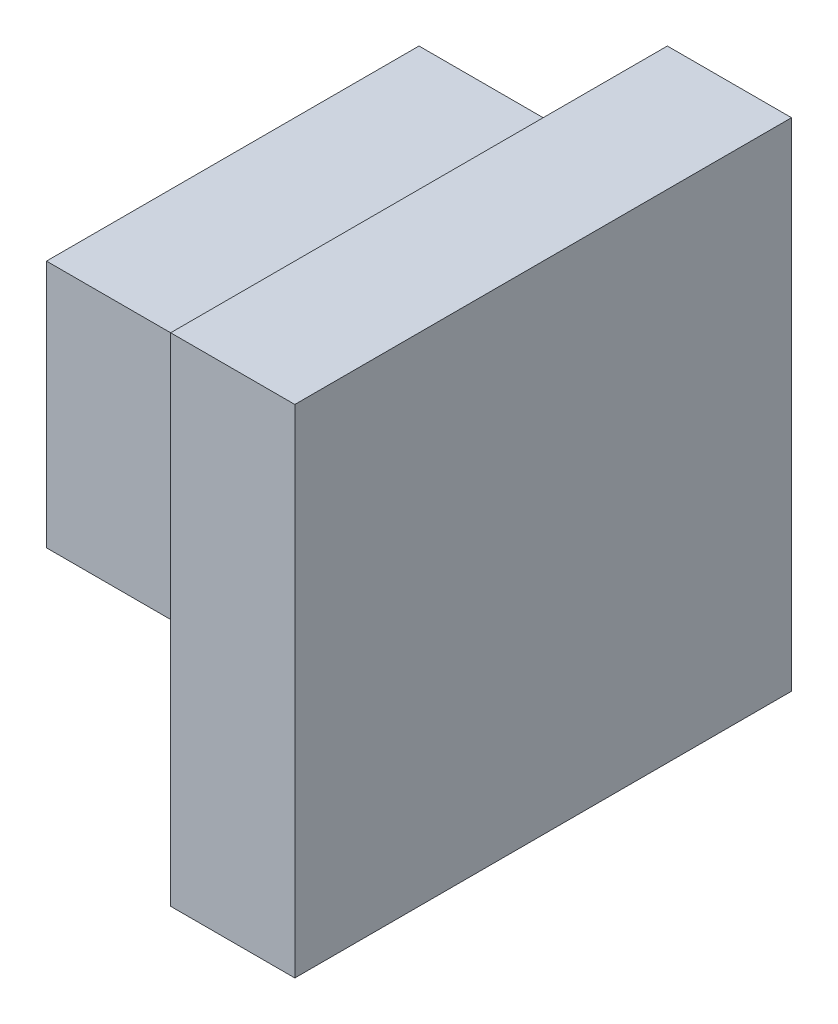
ISO-10303-21;
HEADER;
FILE_DESCRIPTION(('STEP AP214'),'2;1');
FILE_NAME('part.step','',(''),(''),'','','');
FILE_SCHEMA(('AUTOMOTIVE_DESIGN { 1 0 10303 214 1 1 1 1 }'));
ENDSEC;
DATA;
#1=APPLICATION_CONTEXT('core data for automotive mechanical design processes');
#2=APPLICATION_PROTOCOL_DEFINITION('international standard','automotive_design',2000,#1);
#3=PRODUCT_CONTEXT('',#1,'mechanical');
#4=PRODUCT('Part','Part','',(#3));
#5=PRODUCT_RELATED_PRODUCT_CATEGORY('part','',(#4));
#6=PRODUCT_DEFINITION_FORMATION('','',#4);
#7=PRODUCT_DEFINITION_CONTEXT('part definition',#1,'design');
#8=PRODUCT_DEFINITION('design','',#6,#7);
#9=PRODUCT_DEFINITION_SHAPE('','',#8);
#10=(LENGTH_UNIT() NAMED_UNIT(*) SI_UNIT(.MILLI.,.METRE.));
#11=(NAMED_UNIT(*) PLANE_ANGLE_UNIT() SI_UNIT($,.RADIAN.));
#12=(NAMED_UNIT(*) SI_UNIT($,.STERADIAN.) SOLID_ANGLE_UNIT());
#13=UNCERTAINTY_MEASURE_WITH_UNIT(LENGTH_MEASURE(1.E-05),#10,'distance_accuracy_value','');
#14=(GEOMETRIC_REPRESENTATION_CONTEXT(3) GLOBAL_UNCERTAINTY_ASSIGNED_CONTEXT((#13)) GLOBAL_UNIT_ASSIGNED_CONTEXT((#10,
#11,#12)) REPRESENTATION_CONTEXT('',''));
#15=CARTESIAN_POINT('',(0.,0.,0.));
#16=DIRECTION('',(0.,0.,1.));
#17=DIRECTION('',(1.,0.,0.));
#18=AXIS2_PLACEMENT_3D('',#15,#16,#17);
#19=CARTESIAN_POINT('',(3.,1.,4.));
#20=DIRECTION('',(0.,1.,0.));
#21=DIRECTION('',(-1.,0.,0.));
#22=AXIS2_PLACEMENT_3D('',#19,#20,#21);
#23=PLANE('',#22);
#24=DIRECTION('',(1.,0.,0.));
#25=VECTOR('',#24,1.);
#26=CARTESIAN_POINT('',(3.,1.,3.));
#27=LINE('',#26,#25);
#28=CARTESIAN_POINT('',(1.,1.,3.));
#29=VERTEX_POINT('',#28);
#30=CARTESIAN_POINT('',(3.,1.,3.));
#31=VERTEX_POINT('',#30);
#32=EDGE_CURVE('E138',#29,#31,#27,.T.);
#33=ORIENTED_EDGE('',*,*,#32,.F.);
#34=DIRECTION('',(0.,0.,-1.));
#35=VECTOR('',#34,1.);
#36=CARTESIAN_POINT('',(1.,1.,4.));
#37=LINE('',#36,#35);
#38=CARTESIAN_POINT('',(1.,1.,2.));
#39=VERTEX_POINT('',#38);
#40=EDGE_CURVE('E42',#29,#39,#37,.T.);
#41=ORIENTED_EDGE('',*,*,#40,.T.);
#42=CARTESIAN_POINT('',(1.,1.,0.));
#43=VERTEX_POINT('',#42);
#44=EDGE_CURVE('E171',#39,#43,#37,.T.);
#45=ORIENTED_EDGE('',*,*,#44,.T.);
#46=DIRECTION('',(1.,0.,0.));
#47=VECTOR('',#46,1.);
#48=CARTESIAN_POINT('',(3.,1.,0.));
#49=LINE('',#48,#47);
#50=CARTESIAN_POINT('',(3.,1.,0.));
#51=VERTEX_POINT('',#50);
#52=EDGE_CURVE('E179',#43,#51,#49,.T.);
#53=ORIENTED_EDGE('',*,*,#52,.T.);
#54=DIRECTION('',(0.,0.,-1.));
#55=VECTOR('',#54,1.);
#56=CARTESIAN_POINT('',(3.,1.,4.));
#57=LINE('',#56,#55);
#58=EDGE_CURVE('E170',#31,#51,#57,.T.);
#59=ORIENTED_EDGE('',*,*,#58,.F.);
#60=EDGE_LOOP('',(#33,#41,#45,#53,#59));
#61=FACE_BOUND('',#60,.T.);
#62=ADVANCED_FACE('F33',(#61),#23,.F.);
#63=CARTESIAN_POINT('',(1.,3.,4.));
#64=DIRECTION('',(0.,-1.,0.));
#65=DIRECTION('',(0.,0.,-1.));
#66=AXIS2_PLACEMENT_3D('',#63,#64,#65);
#67=PLANE('',#66);
#68=DIRECTION('',(-1.,0.,0.));
#69=VECTOR('',#68,1.);
#70=CARTESIAN_POINT('',(1.,3.,3.));
#71=LINE('',#70,#69);
#72=CARTESIAN_POINT('',(3.,3.,3.));
#73=VERTEX_POINT('',#72);
#74=CARTESIAN_POINT('',(1.,3.,3.));
#75=VERTEX_POINT('',#74);
#76=EDGE_CURVE('E135',#73,#75,#71,.T.);
#77=ORIENTED_EDGE('',*,*,#76,.F.);
#78=DIRECTION('',(0.,0.,-1.));
#79=VECTOR('',#78,1.);
#80=CARTESIAN_POINT('',(3.,3.,4.));
#81=LINE('',#80,#79);
#82=CARTESIAN_POINT('',(3.,3.,0.));
#83=VERTEX_POINT('',#82);
#84=EDGE_CURVE('E147',#73,#83,#81,.T.);
#85=ORIENTED_EDGE('',*,*,#84,.T.);
#86=DIRECTION('',(-1.,0.,0.));
#87=VECTOR('',#86,1.);
#88=CARTESIAN_POINT('',(1.,3.,0.));
#89=LINE('',#88,#87);
#90=CARTESIAN_POINT('',(1.,3.,0.));
#91=VERTEX_POINT('',#90);
#92=EDGE_CURVE('E206',#83,#91,#89,.T.);
#93=ORIENTED_EDGE('',*,*,#92,.T.);
#94=DIRECTION('',(0.,0.,-1.));
#95=VECTOR('',#94,1.);
#96=CARTESIAN_POINT('',(1.,3.,4.));
#97=LINE('',#96,#95);
#98=EDGE_CURVE('E149',#75,#91,#97,.T.);
#99=ORIENTED_EDGE('',*,*,#98,.F.);
#100=EDGE_LOOP('',(#77,#85,#93,#99));
#101=FACE_BOUND('',#100,.T.);
#102=ADVANCED_FACE('F145',(#101),#67,.F.);
#103=CARTESIAN_POINT('',(1.,2.,4.));
#104=DIRECTION('',(1.,0.,0.));
#105=DIRECTION('',(0.,0.,-1.));
#106=AXIS2_PLACEMENT_3D('',#103,#104,#105);
#107=PLANE('',#106);
#108=DIRECTION('',(0.,-1.,0.));
#109=VECTOR('',#108,1.);
#110=CARTESIAN_POINT('',(1.,3.,3.));
#111=LINE('',#110,#109);
#112=EDGE_CURVE('E141',#75,#29,#111,.T.);
#113=ORIENTED_EDGE('',*,*,#112,.F.);
#114=ORIENTED_EDGE('',*,*,#98,.T.);
#115=DIRECTION('',(0.,-1.,0.));
#116=VECTOR('',#115,1.);
#117=CARTESIAN_POINT('',(1.,2.,0.));
#118=LINE('',#117,#116);
#119=CARTESIAN_POINT('',(1.,2.,0.));
#120=VERTEX_POINT('',#119);
#121=EDGE_CURVE('E208',#91,#120,#118,.T.);
#122=ORIENTED_EDGE('',*,*,#121,.T.);
#123=DIRECTION('',(0.,0.,-1.));
#124=VECTOR('',#123,1.);
#125=CARTESIAN_POINT('',(1.,2.,4.));
#126=LINE('',#125,#124);
#127=CARTESIAN_POINT('',(1.,2.,2.));
#128=VERTEX_POINT('',#127);
#129=EDGE_CURVE('E159',#128,#120,#126,.T.);
#130=ORIENTED_EDGE('',*,*,#129,.F.);
#131=DIRECTION('',(0.,1.,0.));
#132=VECTOR('',#131,1.);
#133=CARTESIAN_POINT('',(1.,3.,2.));
#134=LINE('',#133,#132);
#135=EDGE_CURVE('E235',#39,#128,#134,.T.);
#136=ORIENTED_EDGE('',*,*,#135,.F.);
#137=ORIENTED_EDGE('',*,*,#40,.F.);
#138=EDGE_LOOP('',(#113,#114,#122,#130,#136,#137));
#139=FACE_BOUND('',#138,.T.);
#140=ADVANCED_FACE('F226',(#139),#107,.F.);
#141=CARTESIAN_POINT('',(1.,0.,4.));
#142=DIRECTION('',(0.,1.,0.));
#143=DIRECTION('',(-1.,0.,0.));
#144=AXIS2_PLACEMENT_3D('',#141,#142,#143);
#145=PLANE('',#144);
#146=DIRECTION('',(0.,0.,-1.));
#147=VECTOR('',#146,1.);
#148=CARTESIAN_POINT('',(1.,0.,4.));
#149=LINE('',#148,#147);
#150=CARTESIAN_POINT('',(1.,0.,2.));
#151=VERTEX_POINT('',#150);
#152=CARTESIAN_POINT('',(1.,0.,0.));
#153=VERTEX_POINT('',#152);
#154=EDGE_CURVE('E11',#151,#153,#149,.T.);
#155=ORIENTED_EDGE('',*,*,#154,.F.);
#156=DIRECTION('',(1.,0.,0.));
#157=VECTOR('',#156,1.);
#158=CARTESIAN_POINT('',(1.,0.,2.));
#159=LINE('',#158,#157);
#160=CARTESIAN_POINT('',(0.,0.,2.));
#161=VERTEX_POINT('',#160);
#162=EDGE_CURVE('E230',#161,#151,#159,.T.);
#163=ORIENTED_EDGE('',*,*,#162,.F.);
#164=DIRECTION('',(0.,0.,-1.));
#165=VECTOR('',#164,1.);
#166=CARTESIAN_POINT('',(0.,0.,4.));
#167=LINE('',#166,#165);
#168=CARTESIAN_POINT('',(0.,0.,0.));
#169=VERTEX_POINT('',#168);
#170=EDGE_CURVE('E100',#161,#169,#167,.T.);
#171=ORIENTED_EDGE('',*,*,#170,.T.);
#172=DIRECTION('',(1.,0.,0.));
#173=VECTOR('',#172,1.);
#174=CARTESIAN_POINT('',(1.,0.,0.));
#175=LINE('',#174,#173);
#176=EDGE_CURVE('E189',#169,#153,#175,.T.);
#177=ORIENTED_EDGE('',*,*,#176,.T.);
#178=EDGE_LOOP('',(#155,#163,#171,#177));
#179=FACE_BOUND('',#178,.T.);
#180=ADVANCED_FACE('F35',(#179),#145,.F.);
#181=CARTESIAN_POINT('',(1.,1.,4.));
#182=DIRECTION('',(-1.,0.,0.));
#183=DIRECTION('',(0.,0.,1.));
#184=AXIS2_PLACEMENT_3D('',#181,#182,#183);
#185=PLANE('',#184);
#186=ORIENTED_EDGE('',*,*,#44,.F.);
#187=EDGE_CURVE('E231',#151,#39,#134,.T.);
#188=ORIENTED_EDGE('',*,*,#187,.F.);
#189=ORIENTED_EDGE('',*,*,#154,.T.);
#190=DIRECTION('',(0.,1.,0.));
#191=VECTOR('',#190,1.);
#192=CARTESIAN_POINT('',(1.,1.,0.));
#193=LINE('',#192,#191);
#194=EDGE_CURVE('E184',#153,#43,#193,.T.);
#195=ORIENTED_EDGE('',*,*,#194,.T.);
#196=EDGE_LOOP('',(#186,#188,#189,#195));
#197=FACE_BOUND('',#196,.T.);
#198=ADVANCED_FACE('F185',(#197),#185,.F.);
#199=CARTESIAN_POINT('',(4.,0.,4.));
#200=DIRECTION('',(0.,1.,0.));
#201=DIRECTION('',(-1.,0.,0.));
#202=AXIS2_PLACEMENT_3D('',#199,#200,#201);
#203=PLANE('',#202);
#204=DIRECTION('',(1.,0.,0.));
#205=VECTOR('',#204,1.);
#206=CARTESIAN_POINT('',(4.,0.,0.));
#207=LINE('',#206,#205);
#208=CARTESIAN_POINT('',(3.,0.,0.));
#209=VERTEX_POINT('',#208);
#210=CARTESIAN_POINT('',(4.,0.,0.));
#211=VERTEX_POINT('',#210);
#212=EDGE_CURVE('E196',#209,#211,#207,.T.);
#213=ORIENTED_EDGE('',*,*,#212,.T.);
#214=DIRECTION('',(0.,0.,-1.));
#215=VECTOR('',#214,1.);
#216=CARTESIAN_POINT('',(4.,0.,4.));
#217=LINE('',#216,#215);
#218=CARTESIAN_POINT('',(4.,0.,4.));
#219=VERTEX_POINT('',#218);
#220=EDGE_CURVE('E165',#219,#211,#217,.T.);
#221=ORIENTED_EDGE('',*,*,#220,.F.);
#222=DIRECTION('',(1.,0.,0.));
#223=VECTOR('',#222,1.);
#224=CARTESIAN_POINT('',(4.,0.,4.));
#225=LINE('',#224,#223);
#226=CARTESIAN_POINT('',(3.,0.,4.));
#227=VERTEX_POINT('',#226);
#228=EDGE_CURVE('E241',#227,#219,#225,.T.);
#229=ORIENTED_EDGE('',*,*,#228,.F.);
#230=DIRECTION('',(0.,0.,-1.));
#231=VECTOR('',#230,1.);
#232=CARTESIAN_POINT('',(3.,0.,4.));
#233=LINE('',#232,#231);
#234=EDGE_CURVE('E168',#227,#209,#233,.T.);
#235=ORIENTED_EDGE('',*,*,#234,.T.);
#236=EDGE_LOOP('',(#213,#221,#229,#235));
#237=FACE_BOUND('',#236,.T.);
#238=ADVANCED_FACE('F252',(#237),#203,.F.);
#239=CARTESIAN_POINT('',(4.,4.,4.));
#240=DIRECTION('',(-1.,0.,0.));
#241=DIRECTION('',(0.,-1.,0.));
#242=AXIS2_PLACEMENT_3D('',#239,#240,#241);
#243=PLANE('',#242);
#244=DIRECTION('',(0.,1.,0.));
#245=VECTOR('',#244,1.);
#246=CARTESIAN_POINT('',(4.,4.,0.));
#247=LINE('',#246,#245);
#248=CARTESIAN_POINT('',(4.,4.,0.));
#249=VERTEX_POINT('',#248);
#250=EDGE_CURVE('E201',#211,#249,#247,.T.);
#251=ORIENTED_EDGE('',*,*,#250,.T.);
#252=DIRECTION('',(0.,0.,-1.));
#253=VECTOR('',#252,1.);
#254=CARTESIAN_POINT('',(4.,4.,4.));
#255=LINE('',#254,#253);
#256=CARTESIAN_POINT('',(4.,4.,4.));
#257=VERTEX_POINT('',#256);
#258=EDGE_CURVE('E157',#257,#249,#255,.T.);
#259=ORIENTED_EDGE('',*,*,#258,.F.);
#260=DIRECTION('',(0.,1.,0.));
#261=VECTOR('',#260,1.);
#262=CARTESIAN_POINT('',(4.,4.,4.));
#263=LINE('',#262,#261);
#264=EDGE_CURVE('E243',#219,#257,#263,.T.);
#265=ORIENTED_EDGE('',*,*,#264,.F.);
#266=ORIENTED_EDGE('',*,*,#220,.T.);
#267=EDGE_LOOP('',(#251,#259,#265,#266));
#268=FACE_BOUND('',#267,.T.);
#269=ADVANCED_FACE('F255',(#268),#243,.F.);
#270=CARTESIAN_POINT('',(3.,4.,4.));
#271=DIRECTION('',(0.,-1.,0.));
#272=DIRECTION('',(0.,0.,-1.));
#273=AXIS2_PLACEMENT_3D('',#270,#271,#272);
#274=PLANE('',#273);
#275=DIRECTION('',(-1.,0.,0.));
#276=VECTOR('',#275,1.);
#277=CARTESIAN_POINT('',(3.,4.,0.));
#278=LINE('',#277,#276);
#279=CARTESIAN_POINT('',(3.,4.,0.));
#280=VERTEX_POINT('',#279);
#281=EDGE_CURVE('E203',#249,#280,#278,.T.);
#282=ORIENTED_EDGE('',*,*,#281,.T.);
#283=DIRECTION('',(0.,0.,-1.));
#284=VECTOR('',#283,1.);
#285=CARTESIAN_POINT('',(3.,4.,4.));
#286=LINE('',#285,#284);
#287=CARTESIAN_POINT('',(3.,4.,4.));
#288=VERTEX_POINT('',#287);
#289=EDGE_CURVE('E155',#288,#280,#286,.T.);
#290=ORIENTED_EDGE('',*,*,#289,.F.);
#291=DIRECTION('',(-1.,0.,0.));
#292=VECTOR('',#291,1.);
#293=CARTESIAN_POINT('',(3.,4.,4.));
#294=LINE('',#293,#292);
#295=EDGE_CURVE('E216',#257,#288,#294,.T.);
#296=ORIENTED_EDGE('',*,*,#295,.F.);
#297=ORIENTED_EDGE('',*,*,#258,.T.);
#298=EDGE_LOOP('',(#282,#290,#296,#297));
#299=FACE_BOUND('',#298,.T.);
#300=ADVANCED_FACE('F261',(#299),#274,.F.);
#301=CARTESIAN_POINT('',(3.,3.,4.));
#302=DIRECTION('',(1.,0.,0.));
#303=DIRECTION('',(0.,0.,-1.));
#304=AXIS2_PLACEMENT_3D('',#301,#302,#303);
#305=PLANE('',#304);
#306=DIRECTION('',(0.,-1.,0.));
#307=VECTOR('',#306,1.);
#308=CARTESIAN_POINT('',(3.,3.,0.));
#309=LINE('',#308,#307);
#310=EDGE_CURVE('E153',#280,#83,#309,.T.);
#311=ORIENTED_EDGE('',*,*,#310,.T.);
#312=ORIENTED_EDGE('',*,*,#84,.F.);
#313=DIRECTION('',(0.,1.,0.));
#314=VECTOR('',#313,1.);
#315=CARTESIAN_POINT('',(3.,3.,3.));
#316=LINE('',#315,#314);
#317=EDGE_CURVE('E132',#31,#73,#316,.T.);
#318=ORIENTED_EDGE('',*,*,#317,.F.);
#319=ORIENTED_EDGE('',*,*,#58,.T.);
#320=DIRECTION('',(0.,-1.,0.));
#321=VECTOR('',#320,1.);
#322=CARTESIAN_POINT('',(3.,0.,0.));
#323=LINE('',#322,#321);
#324=EDGE_CURVE('E194',#51,#209,#323,.T.);
#325=ORIENTED_EDGE('',*,*,#324,.T.);
#326=ORIENTED_EDGE('',*,*,#234,.F.);
#327=DIRECTION('',(0.,-1.,0.));
#328=VECTOR('',#327,1.);
#329=CARTESIAN_POINT('',(3.,0.,4.));
#330=LINE('',#329,#328);
#331=EDGE_CURVE('E50',#288,#227,#330,.T.);
#332=ORIENTED_EDGE('',*,*,#331,.F.);
#333=ORIENTED_EDGE('',*,*,#289,.T.);
#334=EDGE_LOOP('',(#311,#312,#318,#319,#325,#326,#332,#333));
#335=FACE_BOUND('',#334,.T.);
#336=ADVANCED_FACE('F151',(#335),#305,.F.);
#337=CARTESIAN_POINT('',(0.,2.,4.));
#338=DIRECTION('',(0.,-1.,0.));
#339=DIRECTION('',(1.,0.,0.));
#340=AXIS2_PLACEMENT_3D('',#337,#338,#339);
#341=PLANE('',#340);
#342=DIRECTION('',(0.,0.,-1.));
#343=VECTOR('',#342,1.);
#344=CARTESIAN_POINT('',(0.,2.,4.));
#345=LINE('',#344,#343);
#346=CARTESIAN_POINT('',(0.,2.,2.));
#347=VERTEX_POINT('',#346);
#348=CARTESIAN_POINT('',(0.,2.,0.));
#349=VERTEX_POINT('',#348);
#350=EDGE_CURVE('E92',#347,#349,#345,.T.);
#351=ORIENTED_EDGE('',*,*,#350,.F.);
#352=DIRECTION('',(1.,0.,0.));
#353=VECTOR('',#352,1.);
#354=CARTESIAN_POINT('',(0.,2.,2.));
#355=LINE('',#354,#353);
#356=EDGE_CURVE('E223',#347,#128,#355,.T.);
#357=ORIENTED_EDGE('',*,*,#356,.T.);
#358=ORIENTED_EDGE('',*,*,#129,.T.);
#359=DIRECTION('',(-1.,0.,0.));
#360=VECTOR('',#359,1.);
#361=CARTESIAN_POINT('',(0.,2.,0.));
#362=LINE('',#361,#360);
#363=EDGE_CURVE('E211',#120,#349,#362,.T.);
#364=ORIENTED_EDGE('',*,*,#363,.T.);
#365=EDGE_LOOP('',(#351,#357,#358,#364));
#366=FACE_BOUND('',#365,.T.);
#367=ADVANCED_FACE('F220',(#366),#341,.F.);
#368=CARTESIAN_POINT('',(0.,0.,4.));
#369=DIRECTION('',(1.,0.,0.));
#370=DIRECTION('',(0.,0.,-1.));
#371=AXIS2_PLACEMENT_3D('',#368,#369,#370);
#372=PLANE('',#371);
#373=ORIENTED_EDGE('',*,*,#170,.F.);
#374=DIRECTION('',(0.,-1.,0.));
#375=VECTOR('',#374,1.);
#376=CARTESIAN_POINT('',(0.,3.,2.));
#377=LINE('',#376,#375);
#378=EDGE_CURVE('E228',#347,#161,#377,.T.);
#379=ORIENTED_EDGE('',*,*,#378,.F.);
#380=ORIENTED_EDGE('',*,*,#350,.T.);
#381=DIRECTION('',(0.,-1.,0.));
#382=VECTOR('',#381,1.);
#383=CARTESIAN_POINT('',(0.,0.,0.));
#384=LINE('',#383,#382);
#385=EDGE_CURVE('E213',#349,#169,#384,.T.);
#386=ORIENTED_EDGE('',*,*,#385,.T.);
#387=EDGE_LOOP('',(#373,#379,#380,#386));
#388=FACE_BOUND('',#387,.T.);
#389=ADVANCED_FACE('F227',(#388),#372,.F.);
#390=CARTESIAN_POINT('',(0.,0.,4.));
#391=DIRECTION('',(0.,0.,-1.));
#392=DIRECTION('',(-1.,0.,0.));
#393=AXIS2_PLACEMENT_3D('',#390,#391,#392);
#394=PLANE('',#393);
#395=ORIENTED_EDGE('',*,*,#295,.T.);
#396=ORIENTED_EDGE('',*,*,#331,.T.);
#397=ORIENTED_EDGE('',*,*,#228,.T.);
#398=ORIENTED_EDGE('',*,*,#264,.T.);
#399=EDGE_LOOP('',(#395,#396,#397,#398));
#400=FACE_BOUND('',#399,.T.);
#401=ADVANCED_FACE('F258',(#400),#394,.F.);
#402=CARTESIAN_POINT('',(0.,0.,0.));
#403=DIRECTION('',(0.,0.,-1.));
#404=DIRECTION('',(-1.,0.,0.));
#405=AXIS2_PLACEMENT_3D('',#402,#403,#404);
#406=PLANE('',#405);
#407=ORIENTED_EDGE('',*,*,#176,.F.);
#408=ORIENTED_EDGE('',*,*,#385,.F.);
#409=ORIENTED_EDGE('',*,*,#363,.F.);
#410=ORIENTED_EDGE('',*,*,#121,.F.);
#411=ORIENTED_EDGE('',*,*,#92,.F.);
#412=ORIENTED_EDGE('',*,*,#310,.F.);
#413=ORIENTED_EDGE('',*,*,#281,.F.);
#414=ORIENTED_EDGE('',*,*,#250,.F.);
#415=ORIENTED_EDGE('',*,*,#212,.F.);
#416=ORIENTED_EDGE('',*,*,#324,.F.);
#417=ORIENTED_EDGE('',*,*,#52,.F.);
#418=ORIENTED_EDGE('',*,*,#194,.F.);
#419=EDGE_LOOP('',(#407,#408,#409,#410,#411,#412,#413,#414,#415,#416,#417,#418));
#420=FACE_BOUND('',#419,.T.);
#421=ADVANCED_FACE('F191',(#420),#406,.T.);
#422=CARTESIAN_POINT('',(0.,0.,2.));
#423=DIRECTION('',(0.,0.,-1.));
#424=DIRECTION('',(-1.,0.,0.));
#425=AXIS2_PLACEMENT_3D('',#422,#423,#424);
#426=PLANE('',#425);
#427=ORIENTED_EDGE('',*,*,#378,.T.);
#428=ORIENTED_EDGE('',*,*,#162,.T.);
#429=ORIENTED_EDGE('',*,*,#187,.T.);
#430=ORIENTED_EDGE('',*,*,#135,.T.);
#431=ORIENTED_EDGE('',*,*,#356,.F.);
#432=EDGE_LOOP('',(#427,#428,#429,#430,#431));
#433=FACE_BOUND('',#432,.T.);
#434=ADVANCED_FACE('F245',(#433),#426,.F.);
#435=CARTESIAN_POINT('',(0.,0.,3.));
#436=DIRECTION('',(0.,0.,1.));
#437=DIRECTION('',(1.,0.,0.));
#438=AXIS2_PLACEMENT_3D('',#435,#436,#437);
#439=PLANE('',#438);
#440=ORIENTED_EDGE('',*,*,#32,.T.);
#441=ORIENTED_EDGE('',*,*,#317,.T.);
#442=ORIENTED_EDGE('',*,*,#76,.T.);
#443=ORIENTED_EDGE('',*,*,#112,.T.);
#444=EDGE_LOOP('',(#440,#441,#442,#443));
#445=FACE_BOUND('',#444,.T.);
#446=ADVANCED_FACE('F134',(#445),#439,.T.);
#447=CLOSED_SHELL('',(#62,#102,#140,#180,#198,#238,#269,#300,#336,#367,#389,#401,#421,#434,#446));
#448=MANIFOLD_SOLID_BREP('B2',#447);
#449=ADVANCED_BREP_SHAPE_REPRESENTATION('',(#18,#448),#14);
#450=SHAPE_DEFINITION_REPRESENTATION(#9,#449);
ENDSEC;
END-ISO-10303-21;
